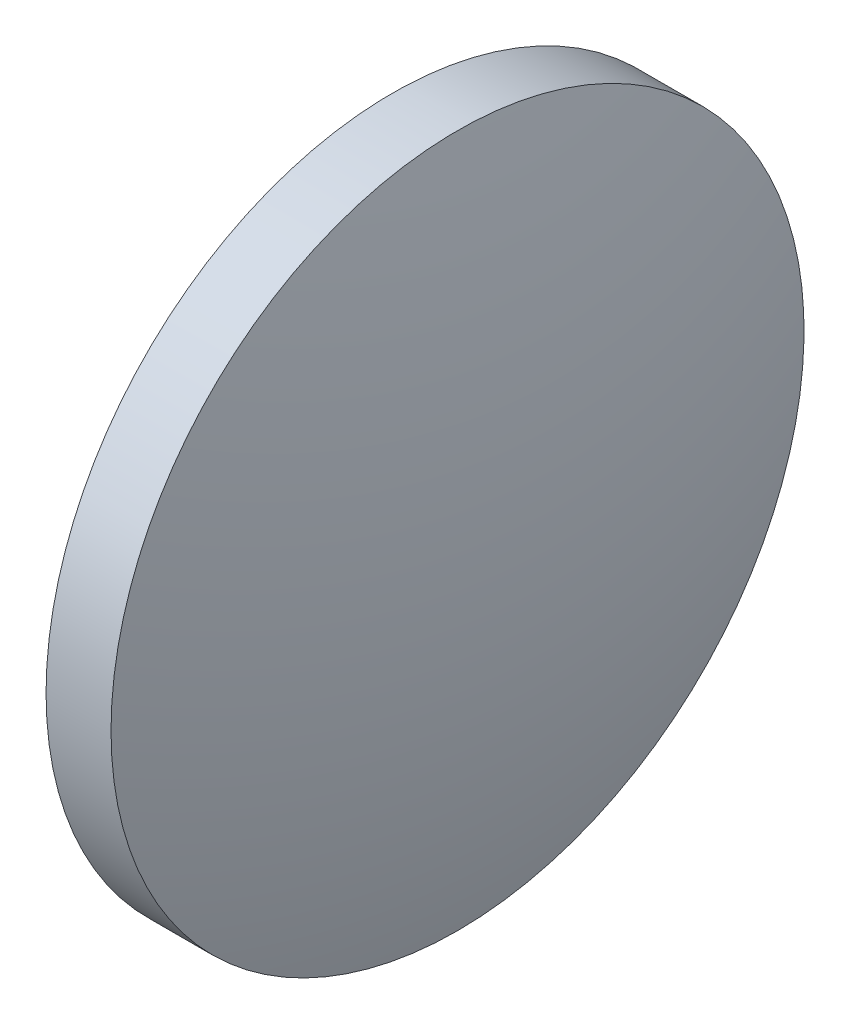
ISO-10303-21;
HEADER;
FILE_DESCRIPTION(('STEP AP214'),'2;1');
FILE_NAME('part.step','',(''),(''),'','','');
FILE_SCHEMA(('AUTOMOTIVE_DESIGN { 1 0 10303 214 1 1 1 1 }'));
ENDSEC;
DATA;
#1=APPLICATION_CONTEXT('core data for automotive mechanical design processes');
#2=APPLICATION_PROTOCOL_DEFINITION('international standard','automotive_design',2000,#1);
#3=PRODUCT_CONTEXT('',#1,'mechanical');
#4=PRODUCT('Part','Part','',(#3));
#5=PRODUCT_RELATED_PRODUCT_CATEGORY('part','',(#4));
#6=PRODUCT_DEFINITION_FORMATION('','',#4);
#7=PRODUCT_DEFINITION_CONTEXT('part definition',#1,'design');
#8=PRODUCT_DEFINITION('design','',#6,#7);
#9=PRODUCT_DEFINITION_SHAPE('','',#8);
#10=(LENGTH_UNIT() NAMED_UNIT(*) SI_UNIT(.MILLI.,.METRE.));
#11=(NAMED_UNIT(*) PLANE_ANGLE_UNIT() SI_UNIT($,.RADIAN.));
#12=(NAMED_UNIT(*) SI_UNIT($,.STERADIAN.) SOLID_ANGLE_UNIT());
#13=UNCERTAINTY_MEASURE_WITH_UNIT(LENGTH_MEASURE(1.E-05),#10,'distance_accuracy_value','');
#14=(GEOMETRIC_REPRESENTATION_CONTEXT(3) GLOBAL_UNCERTAINTY_ASSIGNED_CONTEXT((#13)) GLOBAL_UNIT_ASSIGNED_CONTEXT((#10,
#11,#12)) REPRESENTATION_CONTEXT('',''));
#15=CARTESIAN_POINT('',(0.,0.,0.));
#16=DIRECTION('',(0.,0.,1.));
#17=DIRECTION('',(1.,0.,0.));
#18=AXIS2_PLACEMENT_3D('',#15,#16,#17);
#19=CARTESIAN_POINT('',(582.572877387692,205.970438782681,0.));
#20=DIRECTION('',(-1.,0.,0.));
#21=DIRECTION('',(0.,-1.,0.));
#22=AXIS2_PLACEMENT_3D('',#19,#20,#21);
#23=SPHERICAL_SURFACE('',#22,28.8835840707965);
#24=CARTESIAN_POINT('',(610.326461458488,205.970438782681,0.));
#25=DIRECTION('',(-1.,0.,0.));
#26=DIRECTION('',(0.,0.,1.));
#27=AXIS2_PLACEMENT_3D('',#24,#25,#26);
#28=CIRCLE('',#27,7.99999999999998);
#29=CARTESIAN_POINT('',(610.326461458488,205.970438782681,7.99999999999998));
#30=VERTEX_POINT('',#29);
#31=EDGE_CURVE('E10',#30,#30,#28,.T.);
#32=ORIENTED_EDGE('',*,*,#31,.F.);
#33=EDGE_LOOP('',(#32));
#34=FACE_BOUND('',#33,.T.);
#35=ADVANCED_FACE('F35',(#34),#23,.T.);
#36=CARTESIAN_POINT('',(606.545514053871,205.970438782681,0.));
#37=DIRECTION('',(-1.,0.,0.));
#38=DIRECTION('',(0.,0.,1.));
#39=AXIS2_PLACEMENT_3D('',#36,#37,#38);
#40=CYLINDRICAL_SURFACE('',#39,7.99999999999998);
#41=CARTESIAN_POINT('',(608.826461458488,205.970438782681,0.));
#42=DIRECTION('',(-1.,0.,0.));
#43=DIRECTION('',(0.,0.,1.));
#44=AXIS2_PLACEMENT_3D('',#41,#42,#43);
#45=CIRCLE('',#44,7.99999999999998);
#46=CARTESIAN_POINT('',(608.826461458488,205.970438782681,7.99999999999998));
#47=VERTEX_POINT('',#46);
#48=EDGE_CURVE('E41',#47,#47,#45,.T.);
#49=ORIENTED_EDGE('',*,*,#48,.F.);
#50=EDGE_LOOP('',(#49));
#51=FACE_BOUND('',#50,.T.);
#52=ORIENTED_EDGE('',*,*,#31,.T.);
#53=EDGE_LOOP('',(#52));
#54=FACE_BOUND('',#53,.T.);
#55=ADVANCED_FACE('F49',(#51,#54),#40,.T.);
#56=CARTESIAN_POINT('',(608.826461458488,205.970438782681,0.));
#57=DIRECTION('',(1.,0.,0.));
#58=DIRECTION('',(0.,0.,-1.));
#59=AXIS2_PLACEMENT_3D('',#56,#57,#58);
#60=PLANE('',#59);
#61=ORIENTED_EDGE('',*,*,#48,.T.);
#62=EDGE_LOOP('',(#61));
#63=FACE_BOUND('',#62,.T.);
#64=ADVANCED_FACE('F47',(#63),#60,.F.);
#65=CLOSED_SHELL('',(#35,#55,#64));
#66=MANIFOLD_SOLID_BREP('B2',#65);
#67=ADVANCED_BREP_SHAPE_REPRESENTATION('',(#18,#66),#14);
#68=SHAPE_DEFINITION_REPRESENTATION(#9,#67);
ENDSEC;
END-ISO-10303-21;
